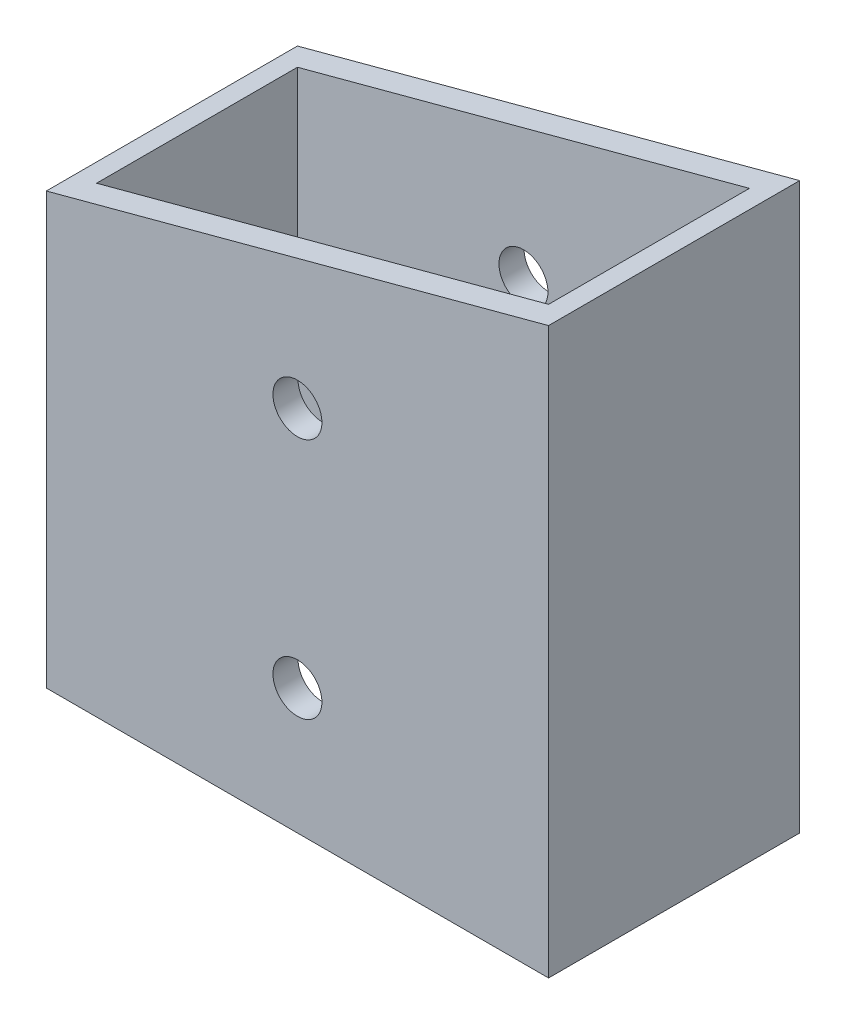
ISO-10303-21;
HEADER;
FILE_DESCRIPTION(('STEP AP214'),'2;1');
FILE_NAME('part.step','',(''),(''),'','','');
FILE_SCHEMA(('AUTOMOTIVE_DESIGN { 1 0 10303 214 1 1 1 1 }'));
ENDSEC;
DATA;
#1=APPLICATION_CONTEXT('core data for automotive mechanical design processes');
#2=APPLICATION_PROTOCOL_DEFINITION('international standard','automotive_design',2000,#1);
#3=PRODUCT_CONTEXT('',#1,'mechanical');
#4=PRODUCT('Part','Part','',(#3));
#5=PRODUCT_RELATED_PRODUCT_CATEGORY('part','',(#4));
#6=PRODUCT_DEFINITION_FORMATION('','',#4);
#7=PRODUCT_DEFINITION_CONTEXT('part definition',#1,'design');
#8=PRODUCT_DEFINITION('design','',#6,#7);
#9=PRODUCT_DEFINITION_SHAPE('','',#8);
#10=(LENGTH_UNIT() NAMED_UNIT(*) SI_UNIT(.MILLI.,.METRE.));
#11=(NAMED_UNIT(*) PLANE_ANGLE_UNIT() SI_UNIT($,.RADIAN.));
#12=(NAMED_UNIT(*) SI_UNIT($,.STERADIAN.) SOLID_ANGLE_UNIT());
#13=UNCERTAINTY_MEASURE_WITH_UNIT(LENGTH_MEASURE(1.E-05),#10,'distance_accuracy_value','');
#14=(GEOMETRIC_REPRESENTATION_CONTEXT(3) GLOBAL_UNCERTAINTY_ASSIGNED_CONTEXT((#13)) GLOBAL_UNIT_ASSIGNED_CONTEXT((#10,
#11,#12)) REPRESENTATION_CONTEXT('',''));
#15=CARTESIAN_POINT('',(0.,0.,0.));
#16=DIRECTION('',(0.,0.,1.));
#17=DIRECTION('',(1.,0.,0.));
#18=AXIS2_PLACEMENT_3D('',#15,#16,#17);
#19=CARTESIAN_POINT('',(25.4,53.975,12.7));
#20=DIRECTION('',(-1.,0.,0.));
#21=DIRECTION('',(0.,0.,1.));
#22=AXIS2_PLACEMENT_3D('',#19,#20,#21);
#23=PLANE('',#22);
#24=DIRECTION('',(0.,-1.,0.));
#25=VECTOR('',#24,1.);
#26=CARTESIAN_POINT('',(25.4,53.975,12.7));
#27=LINE('',#26,#25);
#28=CARTESIAN_POINT('',(25.4,53.975,12.7));
#29=VERTEX_POINT('',#28);
#30=CARTESIAN_POINT('',(25.4,-3.175,12.7));
#31=VERTEX_POINT('',#30);
#32=EDGE_CURVE('E136',#29,#31,#27,.T.);
#33=ORIENTED_EDGE('',*,*,#32,.T.);
#34=DIRECTION('',(0.,0.,1.));
#35=VECTOR('',#34,1.);
#36=CARTESIAN_POINT('',(25.4,-3.175,-12.7));
#37=LINE('',#36,#35);
#38=CARTESIAN_POINT('',(25.4,-3.175,-12.7));
#39=VERTEX_POINT('',#38);
#40=EDGE_CURVE('E73',#39,#31,#37,.T.);
#41=ORIENTED_EDGE('',*,*,#40,.F.);
#42=DIRECTION('',(0.,-1.,0.));
#43=VECTOR('',#42,1.);
#44=CARTESIAN_POINT('',(25.4,53.975,-12.7));
#45=LINE('',#44,#43);
#46=CARTESIAN_POINT('',(25.4,53.975,-12.7));
#47=VERTEX_POINT('',#46);
#48=EDGE_CURVE('E134',#47,#39,#45,.T.);
#49=ORIENTED_EDGE('',*,*,#48,.F.);
#50=DIRECTION('',(0.,0.,-1.));
#51=VECTOR('',#50,1.);
#52=CARTESIAN_POINT('',(25.4,53.975,12.7));
#53=LINE('',#52,#51);
#54=EDGE_CURVE('E202',#29,#47,#53,.T.);
#55=ORIENTED_EDGE('',*,*,#54,.F.);
#56=EDGE_LOOP('',(#33,#41,#49,#55));
#57=FACE_BOUND('',#56,.T.);
#58=ADVANCED_FACE('F57',(#57),#23,.F.);
#59=CARTESIAN_POINT('',(-25.4,53.975,-12.7));
#60=DIRECTION('',(0.,0.,1.));
#61=DIRECTION('',(1.,0.,0.));
#62=AXIS2_PLACEMENT_3D('',#59,#60,#61);
#63=PLANE('',#62);
#64=CARTESIAN_POINT('',(0.,9.52500000000091,-12.7));
#65=DIRECTION('',(0.,0.,-1.));
#66=DIRECTION('',(-1.,0.,0.));
#67=AXIS2_PLACEMENT_3D('',#64,#65,#66);
#68=CIRCLE('',#67,2.4765);
#69=CARTESIAN_POINT('',(-2.47650000000002,9.52500000000091,-12.7));
#70=VERTEX_POINT('',#69);
#71=EDGE_CURVE('E156',#70,#70,#68,.T.);
#72=ORIENTED_EDGE('',*,*,#71,.F.);
#73=EDGE_LOOP('',(#72));
#74=FACE_BOUND('',#73,.T.);
#75=CARTESIAN_POINT('',(0.,34.0210830210416,-12.7));
#76=DIRECTION('',(0.,0.,-1.));
#77=DIRECTION('',(-1.,0.,0.));
#78=AXIS2_PLACEMENT_3D('',#75,#76,#77);
#79=CIRCLE('',#78,2.4765);
#80=CARTESIAN_POINT('',(-2.4765,34.0210830210416,-12.7));
#81=VERTEX_POINT('',#80);
#82=EDGE_CURVE('E166',#81,#81,#79,.T.);
#83=ORIENTED_EDGE('',*,*,#82,.F.);
#84=EDGE_LOOP('',(#83));
#85=FACE_BOUND('',#84,.T.);
#86=ORIENTED_EDGE('',*,*,#48,.T.);
#87=DIRECTION('',(-1.,0.,0.));
#88=VECTOR('',#87,1.);
#89=CARTESIAN_POINT('',(-25.4,-3.175,-12.7));
#90=LINE('',#89,#88);
#91=CARTESIAN_POINT('',(-25.4,-3.175,-12.7));
#92=VERTEX_POINT('',#91);
#93=EDGE_CURVE('E120',#39,#92,#90,.T.);
#94=ORIENTED_EDGE('',*,*,#93,.T.);
#95=DIRECTION('',(0.,-1.,0.));
#96=VECTOR('',#95,1.);
#97=CARTESIAN_POINT('',(-25.4,53.975,-12.7));
#98=LINE('',#97,#96);
#99=CARTESIAN_POINT('',(-25.4,40.3631810244993,-12.7));
#100=VERTEX_POINT('',#99);
#101=EDGE_CURVE('E141',#100,#92,#98,.T.);
#102=ORIENTED_EDGE('',*,*,#101,.F.);
#103=DIRECTION('',(0.96592582628907,0.258819045102515,0.));
#104=VECTOR('',#103,1.);
#105=CARTESIAN_POINT('',(25.4,53.975,-12.7));
#106=LINE('',#105,#104);
#107=EDGE_CURVE('E140',#100,#47,#106,.T.);
#108=ORIENTED_EDGE('',*,*,#107,.T.);
#109=EDGE_LOOP('',(#86,#94,#102,#108));
#110=FACE_BOUND('',#109,.T.);
#111=ADVANCED_FACE('F139',(#74,#85,#110),#63,.F.);
#112=CARTESIAN_POINT('',(-25.4,53.975,12.7));
#113=DIRECTION('',(1.,0.,0.));
#114=DIRECTION('',(0.,0.,-1.));
#115=AXIS2_PLACEMENT_3D('',#112,#113,#114);
#116=PLANE('',#115);
#117=ORIENTED_EDGE('',*,*,#101,.T.);
#118=DIRECTION('',(0.,0.,1.));
#119=VECTOR('',#118,1.);
#120=CARTESIAN_POINT('',(-25.4,-3.175,-12.7));
#121=LINE('',#120,#119);
#122=CARTESIAN_POINT('',(-25.4,-3.175,12.7));
#123=VERTEX_POINT('',#122);
#124=EDGE_CURVE('E123',#92,#123,#121,.T.);
#125=ORIENTED_EDGE('',*,*,#124,.T.);
#126=DIRECTION('',(0.,-1.,0.));
#127=VECTOR('',#126,1.);
#128=CARTESIAN_POINT('',(-25.4,53.975,12.7));
#129=LINE('',#128,#127);
#130=CARTESIAN_POINT('',(-25.4,40.3631810244993,12.7));
#131=VERTEX_POINT('',#130);
#132=EDGE_CURVE('E144',#131,#123,#129,.T.);
#133=ORIENTED_EDGE('',*,*,#132,.F.);
#134=DIRECTION('',(0.,0.,1.));
#135=VECTOR('',#134,1.);
#136=CARTESIAN_POINT('',(-25.4,40.3631810244993,-12.7));
#137=LINE('',#136,#135);
#138=EDGE_CURVE('E181',#100,#131,#137,.T.);
#139=ORIENTED_EDGE('',*,*,#138,.F.);
#140=EDGE_LOOP('',(#117,#125,#133,#139));
#141=FACE_BOUND('',#140,.T.);
#142=ADVANCED_FACE('F211',(#141),#116,.F.);
#143=CARTESIAN_POINT('',(-25.4,53.975,12.7));
#144=DIRECTION('',(0.,0.,-1.));
#145=DIRECTION('',(-1.,0.,0.));
#146=AXIS2_PLACEMENT_3D('',#143,#144,#145);
#147=PLANE('',#146);
#148=CARTESIAN_POINT('',(0.,9.52500000000091,12.7));
#149=DIRECTION('',(0.,0.,-1.));
#150=DIRECTION('',(-1.,0.,0.));
#151=AXIS2_PLACEMENT_3D('',#148,#149,#150);
#152=CIRCLE('',#151,2.4765);
#153=CARTESIAN_POINT('',(-2.47650000000002,9.52500000000091,12.7));
#154=VERTEX_POINT('',#153);
#155=EDGE_CURVE('E150',#154,#154,#152,.T.);
#156=ORIENTED_EDGE('',*,*,#155,.T.);
#157=EDGE_LOOP('',(#156));
#158=FACE_BOUND('',#157,.T.);
#159=CARTESIAN_POINT('',(0.,34.0210830210416,12.7));
#160=DIRECTION('',(0.,0.,-1.));
#161=DIRECTION('',(-1.,0.,0.));
#162=AXIS2_PLACEMENT_3D('',#159,#160,#161);
#163=CIRCLE('',#162,2.4765);
#164=CARTESIAN_POINT('',(-2.4765,34.0210830210416,12.7));
#165=VERTEX_POINT('',#164);
#166=EDGE_CURVE('E161',#165,#165,#163,.T.);
#167=ORIENTED_EDGE('',*,*,#166,.T.);
#168=EDGE_LOOP('',(#167));
#169=FACE_BOUND('',#168,.T.);
#170=ORIENTED_EDGE('',*,*,#132,.T.);
#171=DIRECTION('',(-1.,0.,0.));
#172=VECTOR('',#171,1.);
#173=CARTESIAN_POINT('',(-25.4,-3.175,12.7));
#174=LINE('',#173,#172);
#175=EDGE_CURVE('E128',#31,#123,#174,.T.);
#176=ORIENTED_EDGE('',*,*,#175,.F.);
#177=ORIENTED_EDGE('',*,*,#32,.F.);
#178=DIRECTION('',(0.96592582628907,0.258819045102515,0.));
#179=VECTOR('',#178,1.);
#180=CARTESIAN_POINT('',(25.4,53.975,12.7));
#181=LINE('',#180,#179);
#182=EDGE_CURVE('E179',#131,#29,#181,.T.);
#183=ORIENTED_EDGE('',*,*,#182,.F.);
#184=EDGE_LOOP('',(#170,#176,#177,#183));
#185=FACE_BOUND('',#184,.T.);
#186=ADVANCED_FACE('F208',(#158,#169,#185),#147,.F.);
#187=CARTESIAN_POINT('',(22.86,53.975,0.));
#188=DIRECTION('',(-1.,0.,0.));
#189=DIRECTION('',(0.,0.,1.));
#190=AXIS2_PLACEMENT_3D('',#187,#188,#189);
#191=PLANE('',#190);
#192=DIRECTION('',(0.,0.,-1.));
#193=VECTOR('',#192,1.);
#194=CARTESIAN_POINT('',(22.86,-3.175,0.));
#195=LINE('',#194,#193);
#196=CARTESIAN_POINT('',(22.86,-3.175,10.16));
#197=VERTEX_POINT('',#196);
#198=CARTESIAN_POINT('',(22.86,-3.175,-10.16));
#199=VERTEX_POINT('',#198);
#200=EDGE_CURVE('E177',#197,#199,#195,.T.);
#201=ORIENTED_EDGE('',*,*,#200,.F.);
#202=DIRECTION('',(0.,-1.,0.));
#203=VECTOR('',#202,1.);
#204=CARTESIAN_POINT('',(22.86,53.975,10.16));
#205=LINE('',#204,#203);
#206=CARTESIAN_POINT('',(22.86,53.294409051225,10.16));
#207=VERTEX_POINT('',#206);
#208=EDGE_CURVE('E190',#207,#197,#205,.T.);
#209=ORIENTED_EDGE('',*,*,#208,.F.);
#210=DIRECTION('',(0.,0.,1.));
#211=VECTOR('',#210,1.);
#212=CARTESIAN_POINT('',(22.86,53.294409051225,0.));
#213=LINE('',#212,#211);
#214=CARTESIAN_POINT('',(22.86,53.294409051225,-10.16));
#215=VERTEX_POINT('',#214);
#216=EDGE_CURVE('E188',#215,#207,#213,.T.);
#217=ORIENTED_EDGE('',*,*,#216,.F.);
#218=DIRECTION('',(0.,-1.,0.));
#219=VECTOR('',#218,1.);
#220=CARTESIAN_POINT('',(22.86,53.975,-10.16));
#221=LINE('',#220,#219);
#222=EDGE_CURVE('E199',#215,#199,#221,.T.);
#223=ORIENTED_EDGE('',*,*,#222,.T.);
#224=EDGE_LOOP('',(#201,#209,#217,#223));
#225=FACE_BOUND('',#224,.T.);
#226=ADVANCED_FACE('F241',(#225),#191,.T.);
#227=CARTESIAN_POINT('',(0.,53.975,-10.16));
#228=DIRECTION('',(0.,0.,1.));
#229=DIRECTION('',(1.,0.,0.));
#230=AXIS2_PLACEMENT_3D('',#227,#228,#229);
#231=PLANE('',#230);
#232=CARTESIAN_POINT('',(0.,9.52500000000091,-10.16));
#233=DIRECTION('',(0.,0.,1.));
#234=DIRECTION('',(1.,0.,0.));
#235=AXIS2_PLACEMENT_3D('',#232,#233,#234);
#236=CIRCLE('',#235,2.4765);
#237=CARTESIAN_POINT('',(2.47649999999998,9.52500000000091,-10.16));
#238=VERTEX_POINT('',#237);
#239=EDGE_CURVE('E169',#238,#238,#236,.T.);
#240=ORIENTED_EDGE('',*,*,#239,.F.);
#241=EDGE_LOOP('',(#240));
#242=FACE_BOUND('',#241,.T.);
#243=CARTESIAN_POINT('',(0.,34.0210830210416,-10.16));
#244=DIRECTION('',(0.,0.,1.));
#245=DIRECTION('',(1.,0.,0.));
#246=AXIS2_PLACEMENT_3D('',#243,#244,#245);
#247=CIRCLE('',#246,2.4765);
#248=CARTESIAN_POINT('',(2.4765,34.0210830210416,-10.16));
#249=VERTEX_POINT('',#248);
#250=EDGE_CURVE('E149',#249,#249,#247,.T.);
#251=ORIENTED_EDGE('',*,*,#250,.F.);
#252=EDGE_LOOP('',(#251));
#253=FACE_BOUND('',#252,.T.);
#254=DIRECTION('',(-1.,0.,0.));
#255=VECTOR('',#254,1.);
#256=CARTESIAN_POINT('',(0.,-3.175,-10.16));
#257=LINE('',#256,#255);
#258=CARTESIAN_POINT('',(-22.86,-3.175,-10.16));
#259=VERTEX_POINT('',#258);
#260=EDGE_CURVE('E175',#199,#259,#257,.T.);
#261=ORIENTED_EDGE('',*,*,#260,.F.);
#262=ORIENTED_EDGE('',*,*,#222,.F.);
#263=DIRECTION('',(0.96592582628907,0.258819045102515,0.));
#264=VECTOR('',#263,1.);
#265=CARTESIAN_POINT('',(1.70147737193755,47.6250000000001,-10.16));
#266=LINE('',#265,#264);
#267=CARTESIAN_POINT('',(-22.86,41.0437719732743,-10.16));
#268=VERTEX_POINT('',#267);
#269=EDGE_CURVE('E186',#268,#215,#266,.T.);
#270=ORIENTED_EDGE('',*,*,#269,.F.);
#271=DIRECTION('',(0.,-1.,0.));
#272=VECTOR('',#271,1.);
#273=CARTESIAN_POINT('',(-22.86,53.975,-10.16));
#274=LINE('',#273,#272);
#275=EDGE_CURVE('E196',#268,#259,#274,.T.);
#276=ORIENTED_EDGE('',*,*,#275,.T.);
#277=EDGE_LOOP('',(#261,#262,#270,#276));
#278=FACE_BOUND('',#277,.T.);
#279=ADVANCED_FACE('F244',(#242,#253,#278),#231,.T.);
#280=CARTESIAN_POINT('',(-22.86,53.975,0.));
#281=DIRECTION('',(1.,0.,0.));
#282=DIRECTION('',(0.,0.,-1.));
#283=AXIS2_PLACEMENT_3D('',#280,#281,#282);
#284=PLANE('',#283);
#285=DIRECTION('',(0.,0.,1.));
#286=VECTOR('',#285,1.);
#287=CARTESIAN_POINT('',(-22.86,-3.175,0.));
#288=LINE('',#287,#286);
#289=CARTESIAN_POINT('',(-22.86,-3.175,10.16));
#290=VERTEX_POINT('',#289);
#291=EDGE_CURVE('E80',#259,#290,#288,.T.);
#292=ORIENTED_EDGE('',*,*,#291,.F.);
#293=ORIENTED_EDGE('',*,*,#275,.F.);
#294=DIRECTION('',(0.,0.,-1.));
#295=VECTOR('',#294,1.);
#296=CARTESIAN_POINT('',(-22.86,41.0437719732743,0.));
#297=LINE('',#296,#295);
#298=CARTESIAN_POINT('',(-22.86,41.0437719732744,10.16));
#299=VERTEX_POINT('',#298);
#300=EDGE_CURVE('E184',#299,#268,#297,.T.);
#301=ORIENTED_EDGE('',*,*,#300,.F.);
#302=DIRECTION('',(0.,-1.,0.));
#303=VECTOR('',#302,1.);
#304=CARTESIAN_POINT('',(-22.86,53.975,10.16));
#305=LINE('',#304,#303);
#306=EDGE_CURVE('E193',#299,#290,#305,.T.);
#307=ORIENTED_EDGE('',*,*,#306,.T.);
#308=EDGE_LOOP('',(#292,#293,#301,#307));
#309=FACE_BOUND('',#308,.T.);
#310=ADVANCED_FACE('F224',(#309),#284,.T.);
#311=CARTESIAN_POINT('',(0.,53.975,10.16));
#312=DIRECTION('',(0.,0.,-1.));
#313=DIRECTION('',(-1.,0.,0.));
#314=AXIS2_PLACEMENT_3D('',#311,#312,#313);
#315=PLANE('',#314);
#316=CARTESIAN_POINT('',(0.,9.52500000000091,10.16));
#317=DIRECTION('',(0.,0.,-1.));
#318=DIRECTION('',(-1.,0.,0.));
#319=AXIS2_PLACEMENT_3D('',#316,#317,#318);
#320=CIRCLE('',#319,2.4765);
#321=CARTESIAN_POINT('',(-2.47650000000002,9.52500000000091,10.16));
#322=VERTEX_POINT('',#321);
#323=EDGE_CURVE('E60',#322,#322,#320,.T.);
#324=ORIENTED_EDGE('',*,*,#323,.F.);
#325=EDGE_LOOP('',(#324));
#326=FACE_BOUND('',#325,.T.);
#327=CARTESIAN_POINT('',(0.,34.0210830210416,10.16));
#328=DIRECTION('',(0.,0.,-1.));
#329=DIRECTION('',(-1.,0.,0.));
#330=AXIS2_PLACEMENT_3D('',#327,#328,#329);
#331=CIRCLE('',#330,2.4765);
#332=CARTESIAN_POINT('',(-2.4765,34.0210830210416,10.16));
#333=VERTEX_POINT('',#332);
#334=EDGE_CURVE('E147',#333,#333,#331,.T.);
#335=ORIENTED_EDGE('',*,*,#334,.F.);
#336=EDGE_LOOP('',(#335));
#337=FACE_BOUND('',#336,.T.);
#338=DIRECTION('',(1.,0.,0.));
#339=VECTOR('',#338,1.);
#340=CARTESIAN_POINT('',(0.,-3.175,10.16));
#341=LINE('',#340,#339);
#342=EDGE_CURVE('E12',#290,#197,#341,.T.);
#343=ORIENTED_EDGE('',*,*,#342,.F.);
#344=ORIENTED_EDGE('',*,*,#306,.F.);
#345=DIRECTION('',(-0.96592582628907,-0.258819045102515,0.));
#346=VECTOR('',#345,1.);
#347=CARTESIAN_POINT('',(1.70147737193755,47.6250000000001,10.16));
#348=LINE('',#347,#346);
#349=EDGE_CURVE('E65',#207,#299,#348,.T.);
#350=ORIENTED_EDGE('',*,*,#349,.F.);
#351=ORIENTED_EDGE('',*,*,#208,.T.);
#352=EDGE_LOOP('',(#343,#344,#350,#351));
#353=FACE_BOUND('',#352,.T.);
#354=ADVANCED_FACE('F215',(#326,#337,#353),#315,.T.);
#355=CARTESIAN_POINT('',(25.4,53.975,-12.7));
#356=DIRECTION('',(0.258819045102515,-0.96592582628907,0.));
#357=DIRECTION('',(0.96592582628907,0.258819045102515,0.));
#358=AXIS2_PLACEMENT_3D('',#355,#356,#357);
#359=PLANE('',#358);
#360=ORIENTED_EDGE('',*,*,#216,.T.);
#361=ORIENTED_EDGE('',*,*,#349,.T.);
#362=ORIENTED_EDGE('',*,*,#300,.T.);
#363=ORIENTED_EDGE('',*,*,#269,.T.);
#364=EDGE_LOOP('',(#360,#361,#362,#363));
#365=FACE_BOUND('',#364,.T.);
#366=ORIENTED_EDGE('',*,*,#182,.T.);
#367=ORIENTED_EDGE('',*,*,#54,.T.);
#368=ORIENTED_EDGE('',*,*,#107,.F.);
#369=ORIENTED_EDGE('',*,*,#138,.T.);
#370=EDGE_LOOP('',(#366,#367,#368,#369));
#371=FACE_BOUND('',#370,.T.);
#372=ADVANCED_FACE('F213',(#365,#371),#359,.F.);
#373=CARTESIAN_POINT('',(-25.4,-3.175,-12.7));
#374=DIRECTION('',(0.,1.,0.));
#375=DIRECTION('',(0.,0.,1.));
#376=AXIS2_PLACEMENT_3D('',#373,#374,#375);
#377=PLANE('',#376);
#378=ORIENTED_EDGE('',*,*,#200,.T.);
#379=ORIENTED_EDGE('',*,*,#260,.T.);
#380=ORIENTED_EDGE('',*,*,#291,.T.);
#381=ORIENTED_EDGE('',*,*,#342,.T.);
#382=EDGE_LOOP('',(#378,#379,#380,#381));
#383=FACE_BOUND('',#382,.T.);
#384=ORIENTED_EDGE('',*,*,#175,.T.);
#385=ORIENTED_EDGE('',*,*,#124,.F.);
#386=ORIENTED_EDGE('',*,*,#93,.F.);
#387=ORIENTED_EDGE('',*,*,#40,.T.);
#388=EDGE_LOOP('',(#384,#385,#386,#387));
#389=FACE_BOUND('',#388,.T.);
#390=ADVANCED_FACE('F121',(#383,#389),#377,.F.);
#391=CARTESIAN_POINT('',(0.,34.0210830210416,12.7));
#392=DIRECTION('',(0.,0.,-1.));
#393=DIRECTION('',(-1.,0.,0.));
#394=AXIS2_PLACEMENT_3D('',#391,#392,#393);
#395=CYLINDRICAL_SURFACE('',#394,2.4765);
#396=ORIENTED_EDGE('',*,*,#334,.T.);
#397=EDGE_LOOP('',(#396));
#398=FACE_BOUND('',#397,.T.);
#399=ORIENTED_EDGE('',*,*,#166,.F.);
#400=EDGE_LOOP('',(#399));
#401=FACE_BOUND('',#400,.T.);
#402=ADVANCED_FACE('F222',(#398,#401),#395,.F.);
#403=CARTESIAN_POINT('',(0.,9.52500000000091,12.7));
#404=DIRECTION('',(0.,0.,-1.));
#405=DIRECTION('',(-1.,0.,0.));
#406=AXIS2_PLACEMENT_3D('',#403,#404,#405);
#407=CYLINDRICAL_SURFACE('',#406,2.4765);
#408=ORIENTED_EDGE('',*,*,#323,.T.);
#409=EDGE_LOOP('',(#408));
#410=FACE_BOUND('',#409,.T.);
#411=ORIENTED_EDGE('',*,*,#155,.F.);
#412=EDGE_LOOP('',(#411));
#413=FACE_BOUND('',#412,.T.);
#414=ADVANCED_FACE('F286',(#410,#413),#407,.F.);
#415=ORIENTED_EDGE('',*,*,#250,.T.);
#416=EDGE_LOOP('',(#415));
#417=FACE_BOUND('',#416,.T.);
#418=ORIENTED_EDGE('',*,*,#82,.T.);
#419=EDGE_LOOP('',(#418));
#420=FACE_BOUND('',#419,.T.);
#421=ADVANCED_FACE('F288',(#417,#420),#395,.F.);
#422=ORIENTED_EDGE('',*,*,#239,.T.);
#423=EDGE_LOOP('',(#422));
#424=FACE_BOUND('',#423,.T.);
#425=ORIENTED_EDGE('',*,*,#71,.T.);
#426=EDGE_LOOP('',(#425));
#427=FACE_BOUND('',#426,.T.);
#428=ADVANCED_FACE('F299',(#424,#427),#407,.F.);
#429=CLOSED_SHELL('',(#58,#111,#142,#186,#226,#279,#310,#354,#372,#390,#402,#414,#421,#428));
#430=MANIFOLD_SOLID_BREP('B2',#429);
#431=ADVANCED_BREP_SHAPE_REPRESENTATION('',(#18,#430),#14);
#432=SHAPE_DEFINITION_REPRESENTATION(#9,#431);
ENDSEC;
END-ISO-10303-21;
